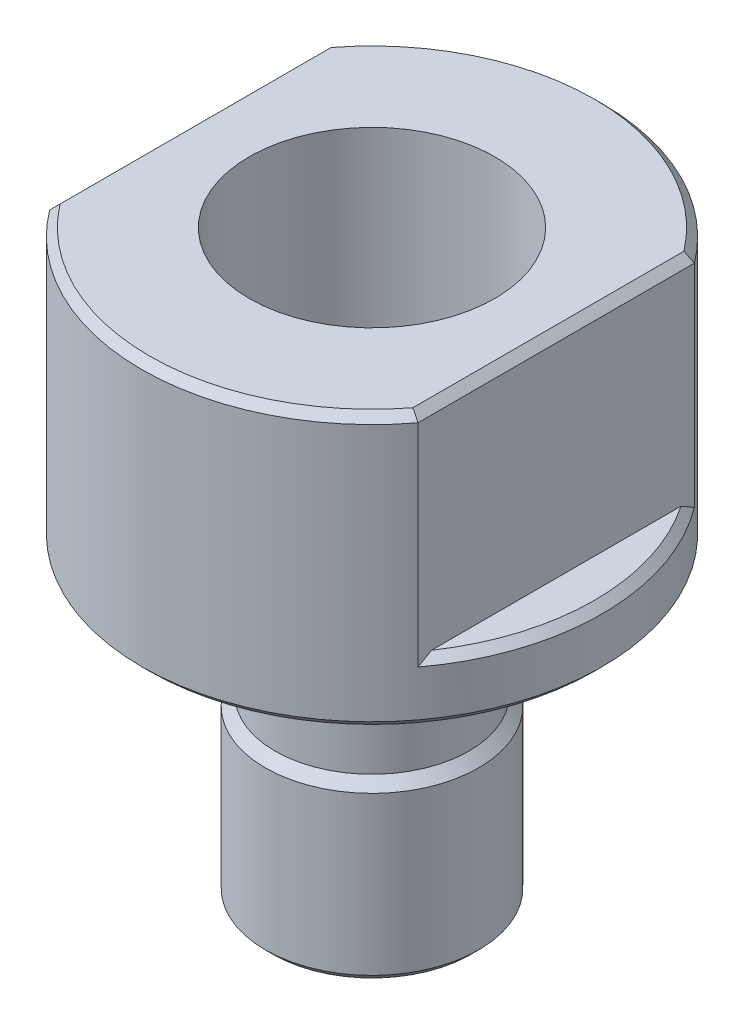
ISO-10303-21;
HEADER;
FILE_DESCRIPTION(('STEP AP214'),'2;1');
FILE_NAME('part.step','',(''),(''),'','','');
FILE_SCHEMA(('AUTOMOTIVE_DESIGN { 1 0 10303 214 1 1 1 1 }'));
ENDSEC;
DATA;
#1=APPLICATION_CONTEXT('core data for automotive mechanical design processes');
#2=APPLICATION_PROTOCOL_DEFINITION('international standard','automotive_design',2000,#1);
#3=PRODUCT_CONTEXT('',#1,'mechanical');
#4=PRODUCT('Part','Part','',(#3));
#5=PRODUCT_RELATED_PRODUCT_CATEGORY('part','',(#4));
#6=PRODUCT_DEFINITION_FORMATION('','',#4);
#7=PRODUCT_DEFINITION_CONTEXT('part definition',#1,'design');
#8=PRODUCT_DEFINITION('design','',#6,#7);
#9=PRODUCT_DEFINITION_SHAPE('','',#8);
#10=(LENGTH_UNIT() NAMED_UNIT(*) SI_UNIT(.MILLI.,.METRE.));
#11=(NAMED_UNIT(*) PLANE_ANGLE_UNIT() SI_UNIT($,.RADIAN.));
#12=(NAMED_UNIT(*) SI_UNIT($,.STERADIAN.) SOLID_ANGLE_UNIT());
#13=UNCERTAINTY_MEASURE_WITH_UNIT(LENGTH_MEASURE(1.E-05),#10,'distance_accuracy_value','');
#14=(GEOMETRIC_REPRESENTATION_CONTEXT(3) GLOBAL_UNCERTAINTY_ASSIGNED_CONTEXT((#13)) GLOBAL_UNIT_ASSIGNED_CONTEXT((#10,
#11,#12)) REPRESENTATION_CONTEXT('',''));
#15=CARTESIAN_POINT('',(0.,0.,0.));
#16=DIRECTION('',(0.,0.,1.));
#17=DIRECTION('',(1.,0.,0.));
#18=AXIS2_PLACEMENT_3D('',#15,#16,#17);
#19=CARTESIAN_POINT('',(4.,0.,0.));
#20=DIRECTION('',(0.,-1.,0.));
#21=DIRECTION('',(0.,0.,-1.));
#22=AXIS2_PLACEMENT_3D('',#19,#20,#21);
#23=PLANE('',#22);
#24=CARTESIAN_POINT('',(0.,0.,0.));
#25=DIRECTION('',(0.,-1.,0.));
#26=DIRECTION('',(0.,0.,-1.));
#27=AXIS2_PLACEMENT_3D('',#24,#25,#26);
#28=CIRCLE('',#27,7.246);
#29=CARTESIAN_POINT('',(5.746,0.,-4.41452149162284));
#30=VERTEX_POINT('',#29);
#31=CARTESIAN_POINT('',(-5.746,0.,-4.41452149162285));
#32=VERTEX_POINT('',#31);
#33=EDGE_CURVE('E124',#30,#32,#28,.F.);
#34=ORIENTED_EDGE('',*,*,#33,.T.);
#35=DIRECTION('',(0.,0.,1.));
#36=VECTOR('',#35,1.);
#37=CARTESIAN_POINT('',(-5.746,0.,4.5));
#38=LINE('',#37,#36);
#39=CARTESIAN_POINT('',(-5.746,0.,4.41452149162285));
#40=VERTEX_POINT('',#39);
#41=EDGE_CURVE('E153',#32,#40,#38,.T.);
#42=ORIENTED_EDGE('',*,*,#41,.T.);
#43=CARTESIAN_POINT('',(0.,0.,0.));
#44=DIRECTION('',(0.,-1.,0.));
#45=DIRECTION('',(0.,0.,-1.));
#46=AXIS2_PLACEMENT_3D('',#43,#44,#45);
#47=CIRCLE('',#46,7.246);
#48=CARTESIAN_POINT('',(5.746,0.,4.41452149162284));
#49=VERTEX_POINT('',#48);
#50=EDGE_CURVE('E127',#40,#49,#47,.F.);
#51=ORIENTED_EDGE('',*,*,#50,.T.);
#52=DIRECTION('',(0.,0.,-1.));
#53=VECTOR('',#52,1.);
#54=CARTESIAN_POINT('',(5.746,0.,-4.5));
#55=LINE('',#54,#53);
#56=EDGE_CURVE('E119',#49,#30,#55,.T.);
#57=ORIENTED_EDGE('',*,*,#56,.T.);
#58=EDGE_LOOP('',(#34,#42,#51,#57));
#59=FACE_BOUND('',#58,.T.);
#60=CARTESIAN_POINT('',(0.,0.,0.));
#61=DIRECTION('',(0.,1.,0.));
#62=DIRECTION('',(0.,0.,1.));
#63=AXIS2_PLACEMENT_3D('',#60,#61,#62);
#64=CIRCLE('',#63,4.);
#65=CARTESIAN_POINT('',(0.,0.,4.));
#66=VERTEX_POINT('',#65);
#67=EDGE_CURVE('E337',#66,#66,#64,.T.);
#68=ORIENTED_EDGE('',*,*,#67,.F.);
#69=EDGE_LOOP('',(#68));
#70=FACE_BOUND('',#69,.T.);
#71=ADVANCED_FACE('F50',(#59,#70),#23,.F.);
#72=CARTESIAN_POINT('',(0.,0.,0.));
#73=DIRECTION('',(0.,1.,0.));
#74=DIRECTION('',(0.,0.,1.));
#75=AXIS2_PLACEMENT_3D('',#72,#73,#74);
#76=CYLINDRICAL_SURFACE('',#75,7.5);
#77=CARTESIAN_POINT('',(0.,-8.636,0.));
#78=DIRECTION('',(0.,1.,0.));
#79=DIRECTION('',(0.,0.,1.));
#80=AXIS2_PLACEMENT_3D('',#77,#78,#79);
#81=CIRCLE('',#80,7.5);
#82=CARTESIAN_POINT('',(0.,-8.636,7.5));
#83=VERTEX_POINT('',#82);
#84=EDGE_CURVE('E148',#83,#83,#81,.T.);
#85=ORIENTED_EDGE('',*,*,#84,.T.);
#86=EDGE_LOOP('',(#85));
#87=FACE_BOUND('',#86,.T.);
#88=DIRECTION('',(0.,1.,0.));
#89=VECTOR('',#88,1.);
#90=CARTESIAN_POINT('',(-6.,0.,4.5));
#91=LINE('',#90,#89);
#92=CARTESIAN_POINT('',(-6.,-7.14399999999999,4.5));
#93=VERTEX_POINT('',#92);
#94=CARTESIAN_POINT('',(-6.,-0.253999999999996,4.5));
#95=VERTEX_POINT('',#94);
#96=EDGE_CURVE('E305',#93,#95,#91,.T.);
#97=ORIENTED_EDGE('',*,*,#96,.F.);
#98=CARTESIAN_POINT('',(0.,-7.14399999999999,0.));
#99=DIRECTION('',(0.,1.,0.));
#100=DIRECTION('',(0.,0.,1.));
#101=AXIS2_PLACEMENT_3D('',#98,#99,#100);
#102=CIRCLE('',#101,7.5);
#103=CARTESIAN_POINT('',(-6.,-7.14399999999999,-4.5));
#104=VERTEX_POINT('',#103);
#105=EDGE_CURVE('E202',#93,#104,#102,.F.);
#106=ORIENTED_EDGE('',*,*,#105,.T.);
#107=DIRECTION('',(0.,1.,0.));
#108=VECTOR('',#107,1.);
#109=CARTESIAN_POINT('',(-6.,0.,-4.5));
#110=LINE('',#109,#108);
#111=CARTESIAN_POINT('',(-6.,-0.253999999999996,-4.5));
#112=VERTEX_POINT('',#111);
#113=EDGE_CURVE('E308',#112,#104,#110,.F.);
#114=ORIENTED_EDGE('',*,*,#113,.F.);
#115=CARTESIAN_POINT('',(0.,-0.253999999999996,0.));
#116=DIRECTION('',(0.,-1.,0.));
#117=DIRECTION('',(0.,0.,-1.));
#118=AXIS2_PLACEMENT_3D('',#115,#116,#117);
#119=CIRCLE('',#118,7.5);
#120=CARTESIAN_POINT('',(6.,-0.253999999999996,-4.5));
#121=VERTEX_POINT('',#120);
#122=EDGE_CURVE('E158',#112,#121,#119,.T.);
#123=ORIENTED_EDGE('',*,*,#122,.T.);
#124=DIRECTION('',(0.,1.,0.));
#125=VECTOR('',#124,1.);
#126=CARTESIAN_POINT('',(6.,0.,-4.5));
#127=LINE('',#126,#125);
#128=CARTESIAN_POINT('',(6.,-7.14399999999999,-4.5));
#129=VERTEX_POINT('',#128);
#130=EDGE_CURVE('E300',#129,#121,#127,.T.);
#131=ORIENTED_EDGE('',*,*,#130,.F.);
#132=CARTESIAN_POINT('',(0.,-7.14399999999999,0.));
#133=DIRECTION('',(0.,1.,0.));
#134=DIRECTION('',(0.,0.,1.));
#135=AXIS2_PLACEMENT_3D('',#132,#133,#134);
#136=CIRCLE('',#135,7.5);
#137=CARTESIAN_POINT('',(6.,-7.14399999999999,4.5));
#138=VERTEX_POINT('',#137);
#139=EDGE_CURVE('E199',#129,#138,#136,.F.);
#140=ORIENTED_EDGE('',*,*,#139,.T.);
#141=DIRECTION('',(0.,1.,0.));
#142=VECTOR('',#141,1.);
#143=CARTESIAN_POINT('',(6.,0.,4.5));
#144=LINE('',#143,#142);
#145=CARTESIAN_POINT('',(6.,-0.253999999999997,4.5));
#146=VERTEX_POINT('',#145);
#147=EDGE_CURVE('E303',#146,#138,#144,.F.);
#148=ORIENTED_EDGE('',*,*,#147,.F.);
#149=CARTESIAN_POINT('',(0.,-0.253999999999996,0.));
#150=DIRECTION('',(0.,-1.,0.));
#151=DIRECTION('',(0.,0.,-1.));
#152=AXIS2_PLACEMENT_3D('',#149,#150,#151);
#153=CIRCLE('',#152,7.5);
#154=EDGE_CURVE('E160',#146,#95,#153,.T.);
#155=ORIENTED_EDGE('',*,*,#154,.T.);
#156=EDGE_LOOP('',(#97,#106,#114,#123,#131,#140,#148,#155));
#157=FACE_BOUND('',#156,.T.);
#158=ADVANCED_FACE('F272',(#87,#157),#76,.T.);
#159=CARTESIAN_POINT('',(7.5,-8.89,0.));
#160=DIRECTION('',(0.,1.,0.));
#161=DIRECTION('',(0.,0.,1.));
#162=AXIS2_PLACEMENT_3D('',#159,#160,#161);
#163=PLANE('',#162);
#164=CARTESIAN_POINT('',(0.,-8.89,0.));
#165=DIRECTION('',(0.,1.,0.));
#166=DIRECTION('',(0.,0.,1.));
#167=AXIS2_PLACEMENT_3D('',#164,#165,#166);
#168=CIRCLE('',#167,7.246);
#169=CARTESIAN_POINT('',(0.,-8.89,7.246));
#170=VERTEX_POINT('',#169);
#171=EDGE_CURVE('E145',#170,#170,#168,.F.);
#172=ORIENTED_EDGE('',*,*,#171,.T.);
#173=EDGE_LOOP('',(#172));
#174=FACE_BOUND('',#173,.T.);
#175=CARTESIAN_POINT('',(0.,-8.89,0.));
#176=DIRECTION('',(0.,1.,0.));
#177=DIRECTION('',(0.,0.,1.));
#178=AXIS2_PLACEMENT_3D('',#175,#176,#177);
#179=CIRCLE('',#178,3.475);
#180=CARTESIAN_POINT('',(0.,-8.89,3.475));
#181=VERTEX_POINT('',#180);
#182=EDGE_CURVE('E310',#181,#181,#179,.T.);
#183=ORIENTED_EDGE('',*,*,#182,.T.);
#184=EDGE_LOOP('',(#183));
#185=FACE_BOUND('',#184,.T.);
#186=ADVANCED_FACE('F268',(#174,#185),#163,.F.);
#187=CARTESIAN_POINT('',(0.,0.,0.));
#188=DIRECTION('',(0.,1.,0.));
#189=DIRECTION('',(0.,0.,1.));
#190=AXIS2_PLACEMENT_3D('',#187,#188,#189);
#191=CYLINDRICAL_SURFACE('',#190,3.475);
#192=ORIENTED_EDGE('',*,*,#182,.F.);
#193=EDGE_LOOP('',(#192));
#194=FACE_BOUND('',#193,.T.);
#195=CARTESIAN_POINT('',(0.,-10.89,0.));
#196=DIRECTION('',(0.,1.,0.));
#197=DIRECTION('',(0.,0.,1.));
#198=AXIS2_PLACEMENT_3D('',#195,#196,#197);
#199=CIRCLE('',#198,3.475);
#200=CARTESIAN_POINT('',(0.,-10.89,3.475));
#201=VERTEX_POINT('',#200);
#202=EDGE_CURVE('E313',#201,#201,#199,.T.);
#203=ORIENTED_EDGE('',*,*,#202,.T.);
#204=EDGE_LOOP('',(#203));
#205=FACE_BOUND('',#204,.T.);
#206=ADVANCED_FACE('F264',(#194,#205),#191,.T.);
#207=CARTESIAN_POINT('',(0.,-11.2058647091106,0.));
#208=DIRECTION('',(0.,1.,0.));
#209=DIRECTION('',(0.,0.,1.));
#210=AXIS2_PLACEMENT_3D('',#207,#208,#209);
#211=CONICAL_SURFACE('',#210,3.15913529088937,0.78539816339745);
#212=ORIENTED_EDGE('',*,*,#202,.F.);
#213=EDGE_LOOP('',(#212));
#214=FACE_BOUND('',#213,.T.);
#215=CARTESIAN_POINT('',(0.,-11.2058647091106,0.));
#216=DIRECTION('',(0.,1.,0.));
#217=DIRECTION('',(0.,0.,1.));
#218=AXIS2_PLACEMENT_3D('',#215,#216,#217);
#219=CIRCLE('',#218,3.15913529088937);
#220=CARTESIAN_POINT('',(0.,-11.2058647091106,3.15913529088937));
#221=VERTEX_POINT('',#220);
#222=EDGE_CURVE('E316',#221,#221,#219,.T.);
#223=ORIENTED_EDGE('',*,*,#222,.T.);
#224=EDGE_LOOP('',(#223));
#225=FACE_BOUND('',#224,.T.);
#226=ADVANCED_FACE('F260',(#214,#225),#211,.T.);
#227=CARTESIAN_POINT('',(0.,0.,0.));
#228=DIRECTION('',(0.,1.,0.));
#229=DIRECTION('',(0.,0.,1.));
#230=AXIS2_PLACEMENT_3D('',#227,#228,#229);
#231=CYLINDRICAL_SURFACE('',#230,3.15913529088937);
#232=ORIENTED_EDGE('',*,*,#222,.F.);
#233=EDGE_LOOP('',(#232));
#234=FACE_BOUND('',#233,.T.);
#235=CARTESIAN_POINT('',(0.,-13.1858647091106,0.));
#236=DIRECTION('',(0.,1.,0.));
#237=DIRECTION('',(0.,0.,1.));
#238=AXIS2_PLACEMENT_3D('',#235,#236,#237);
#239=CIRCLE('',#238,3.15913529088937);
#240=CARTESIAN_POINT('',(0.,-13.1858647091106,3.15913529088937));
#241=VERTEX_POINT('',#240);
#242=EDGE_CURVE('E319',#241,#241,#239,.T.);
#243=ORIENTED_EDGE('',*,*,#242,.T.);
#244=EDGE_LOOP('',(#243));
#245=FACE_BOUND('',#244,.T.);
#246=ADVANCED_FACE('F256',(#234,#245),#231,.T.);
#247=CARTESIAN_POINT('',(0.,-13.5017294182212,0.));
#248=DIRECTION('',(0.,-1.,0.));
#249=DIRECTION('',(0.,0.,-1.));
#250=AXIS2_PLACEMENT_3D('',#247,#248,#249);
#251=CONICAL_SURFACE('',#250,3.475,0.785398163397452);
#252=ORIENTED_EDGE('',*,*,#242,.F.);
#253=EDGE_LOOP('',(#252));
#254=FACE_BOUND('',#253,.T.);
#255=CARTESIAN_POINT('',(0.,-13.5017294182212,0.));
#256=DIRECTION('',(0.,1.,0.));
#257=DIRECTION('',(0.,0.,1.));
#258=AXIS2_PLACEMENT_3D('',#255,#256,#257);
#259=CIRCLE('',#258,3.475);
#260=CARTESIAN_POINT('',(0.,-13.5017294182212,3.475));
#261=VERTEX_POINT('',#260);
#262=EDGE_CURVE('E322',#261,#261,#259,.T.);
#263=ORIENTED_EDGE('',*,*,#262,.T.);
#264=EDGE_LOOP('',(#263));
#265=FACE_BOUND('',#264,.T.);
#266=ADVANCED_FACE('F252',(#254,#265),#251,.T.);
#267=CARTESIAN_POINT('',(0.,0.,0.));
#268=DIRECTION('',(0.,1.,0.));
#269=DIRECTION('',(0.,0.,1.));
#270=AXIS2_PLACEMENT_3D('',#267,#268,#269);
#271=CYLINDRICAL_SURFACE('',#270,3.475);
#272=CARTESIAN_POINT('',(0.,-18.636,0.));
#273=DIRECTION('',(0.,1.,0.));
#274=DIRECTION('',(0.,0.,1.));
#275=AXIS2_PLACEMENT_3D('',#272,#273,#274);
#276=CIRCLE('',#275,3.475);
#277=CARTESIAN_POINT('',(0.,-18.636,3.475));
#278=VERTEX_POINT('',#277);
#279=EDGE_CURVE('E295',#278,#278,#276,.T.);
#280=ORIENTED_EDGE('',*,*,#279,.T.);
#281=EDGE_LOOP('',(#280));
#282=FACE_BOUND('',#281,.T.);
#283=ORIENTED_EDGE('',*,*,#262,.F.);
#284=EDGE_LOOP('',(#283));
#285=FACE_BOUND('',#284,.T.);
#286=ADVANCED_FACE('F248',(#282,#285),#271,.T.);
#287=CARTESIAN_POINT('',(3.475,-18.89,0.));
#288=DIRECTION('',(0.,1.,0.));
#289=DIRECTION('',(0.,0.,1.));
#290=AXIS2_PLACEMENT_3D('',#287,#288,#289);
#291=PLANE('',#290);
#292=CARTESIAN_POINT('',(0.,-18.89,0.));
#293=DIRECTION('',(0.,1.,0.));
#294=DIRECTION('',(0.,0.,1.));
#295=AXIS2_PLACEMENT_3D('',#292,#293,#294);
#296=CIRCLE('',#295,3.22100000000001);
#297=CARTESIAN_POINT('',(0.,-18.89,3.22100000000001));
#298=VERTEX_POINT('',#297);
#299=EDGE_CURVE('E293',#298,#298,#296,.F.);
#300=ORIENTED_EDGE('',*,*,#299,.T.);
#301=EDGE_LOOP('',(#300));
#302=FACE_BOUND('',#301,.T.);
#303=CARTESIAN_POINT('',(0.,-18.89,0.));
#304=DIRECTION('',(0.,1.,0.));
#305=DIRECTION('',(0.,0.,1.));
#306=AXIS2_PLACEMENT_3D('',#303,#304,#305);
#307=CIRCLE('',#306,2.0381);
#308=CARTESIAN_POINT('',(0.,-18.89,2.0381));
#309=VERTEX_POINT('',#308);
#310=EDGE_CURVE('E325',#309,#309,#307,.T.);
#311=ORIENTED_EDGE('',*,*,#310,.T.);
#312=EDGE_LOOP('',(#311));
#313=FACE_BOUND('',#312,.T.);
#314=ADVANCED_FACE('F244',(#302,#313),#291,.F.);
#315=CARTESIAN_POINT('',(0.,0.,0.));
#316=DIRECTION('',(0.,1.,0.));
#317=DIRECTION('',(0.,0.,1.));
#318=AXIS2_PLACEMENT_3D('',#315,#316,#317);
#319=CYLINDRICAL_SURFACE('',#318,2.0381);
#320=ORIENTED_EDGE('',*,*,#310,.F.);
#321=EDGE_LOOP('',(#320));
#322=FACE_BOUND('',#321,.T.);
#323=CARTESIAN_POINT('',(0.,-8.02690000000001,0.));
#324=DIRECTION('',(0.,1.,0.));
#325=DIRECTION('',(0.,0.,1.));
#326=AXIS2_PLACEMENT_3D('',#323,#324,#325);
#327=CIRCLE('',#326,2.0381);
#328=CARTESIAN_POINT('',(0.,-8.02690000000001,2.0381));
#329=VERTEX_POINT('',#328);
#330=EDGE_CURVE('E328',#329,#329,#327,.T.);
#331=ORIENTED_EDGE('',*,*,#330,.T.);
#332=EDGE_LOOP('',(#331));
#333=FACE_BOUND('',#332,.T.);
#334=ADVANCED_FACE('F240',(#322,#333),#319,.F.);
#335=CARTESIAN_POINT('',(0.,-6.89,0.));
#336=DIRECTION('',(0.,1.,0.));
#337=DIRECTION('',(0.,0.,1.));
#338=AXIS2_PLACEMENT_3D('',#335,#336,#337);
#339=CONICAL_SURFACE('',#338,3.175,0.785398163397443);
#340=ORIENTED_EDGE('',*,*,#330,.F.);
#341=EDGE_LOOP('',(#340));
#342=FACE_BOUND('',#341,.T.);
#343=CARTESIAN_POINT('',(0.,-6.89,0.));
#344=DIRECTION('',(0.,1.,0.));
#345=DIRECTION('',(0.,0.,1.));
#346=AXIS2_PLACEMENT_3D('',#343,#344,#345);
#347=CIRCLE('',#346,3.175);
#348=CARTESIAN_POINT('',(0.,-6.89,3.175));
#349=VERTEX_POINT('',#348);
#350=EDGE_CURVE('E331',#349,#349,#347,.T.);
#351=ORIENTED_EDGE('',*,*,#350,.T.);
#352=EDGE_LOOP('',(#351));
#353=FACE_BOUND('',#352,.T.);
#354=ADVANCED_FACE('F236',(#342,#353),#339,.F.);
#355=CARTESIAN_POINT('',(4.,-6.89,0.));
#356=DIRECTION('',(0.,-1.,0.));
#357=DIRECTION('',(0.,0.,-1.));
#358=AXIS2_PLACEMENT_3D('',#355,#356,#357);
#359=PLANE('',#358);
#360=ORIENTED_EDGE('',*,*,#350,.F.);
#361=EDGE_LOOP('',(#360));
#362=FACE_BOUND('',#361,.T.);
#363=CARTESIAN_POINT('',(0.,-6.89,0.));
#364=DIRECTION('',(0.,1.,0.));
#365=DIRECTION('',(0.,0.,1.));
#366=AXIS2_PLACEMENT_3D('',#363,#364,#365);
#367=CIRCLE('',#366,4.);
#368=CARTESIAN_POINT('',(0.,-6.89,4.));
#369=VERTEX_POINT('',#368);
#370=EDGE_CURVE('E334',#369,#369,#367,.T.);
#371=ORIENTED_EDGE('',*,*,#370,.T.);
#372=EDGE_LOOP('',(#371));
#373=FACE_BOUND('',#372,.T.);
#374=ADVANCED_FACE('F232',(#362,#373),#359,.F.);
#375=CARTESIAN_POINT('',(0.,0.,0.));
#376=DIRECTION('',(0.,1.,0.));
#377=DIRECTION('',(0.,0.,1.));
#378=AXIS2_PLACEMENT_3D('',#375,#376,#377);
#379=CYLINDRICAL_SURFACE('',#378,4.);
#380=ORIENTED_EDGE('',*,*,#370,.F.);
#381=EDGE_LOOP('',(#380));
#382=FACE_BOUND('',#381,.T.);
#383=ORIENTED_EDGE('',*,*,#67,.T.);
#384=EDGE_LOOP('',(#383));
#385=FACE_BOUND('',#384,.T.);
#386=ADVANCED_FACE('F228',(#382,#385),#379,.F.);
#387=CARTESIAN_POINT('',(7.5,-6.89,0.));
#388=DIRECTION('',(0.,1.,0.));
#389=DIRECTION('',(0.,0.,1.));
#390=AXIS2_PLACEMENT_3D('',#387,#388,#389);
#391=PLANE('',#390);
#392=DIRECTION('',(0.,0.,-1.));
#393=VECTOR('',#392,1.);
#394=CARTESIAN_POINT('',(-6.,-6.89,10.276728133274));
#395=LINE('',#394,#393);
#396=CARTESIAN_POINT('',(-6.,-6.89,4.0625750454607));
#397=VERTEX_POINT('',#396);
#398=CARTESIAN_POINT('',(-6.,-6.89,-4.0625750454607));
#399=VERTEX_POINT('',#398);
#400=EDGE_CURVE('E139',#397,#399,#395,.T.);
#401=ORIENTED_EDGE('',*,*,#400,.T.);
#402=CARTESIAN_POINT('',(0.,-6.89,0.));
#403=DIRECTION('',(0.,1.,0.));
#404=DIRECTION('',(0.,0.,1.));
#405=AXIS2_PLACEMENT_3D('',#402,#403,#404);
#406=CIRCLE('',#405,7.246);
#407=EDGE_CURVE('E163',#399,#397,#406,.T.);
#408=ORIENTED_EDGE('',*,*,#407,.T.);
#409=EDGE_LOOP('',(#401,#408));
#410=FACE_BOUND('',#409,.T.);
#411=ADVANCED_FACE('F224',(#410),#391,.T.);
#412=CARTESIAN_POINT('',(-6.,-44.5468545929938,10.276728133274));
#413=DIRECTION('',(-1.,0.,0.));
#414=DIRECTION('',(0.,0.,1.));
#415=AXIS2_PLACEMENT_3D('',#412,#413,#414);
#416=PLANE('',#415);
#417=ORIENTED_EDGE('',*,*,#96,.T.);
#418=DIRECTION('',(0.,0.,-1.));
#419=VECTOR('',#418,1.);
#420=CARTESIAN_POINT('',(-6.,-0.253999999999997,-4.5));
#421=LINE('',#420,#419);
#422=EDGE_CURVE('E155',#95,#112,#421,.T.);
#423=ORIENTED_EDGE('',*,*,#422,.T.);
#424=ORIENTED_EDGE('',*,*,#113,.T.);
#425=CARTESIAN_POINT('',(-6.,-7.14399999999999,-4.5));
#426=CARTESIAN_POINT('',(-6.,-7.10059466470886,-4.42771841219986));
#427=CARTESIAN_POINT('',(-6.,-7.05772534961156,-4.3551255729954));
#428=CARTESIAN_POINT('',(-6.,-6.97305868094794,-4.20931725597521));
#429=CARTESIAN_POINT('',(-6.,-6.93126132937858,-4.1361017769999));
#430=CARTESIAN_POINT('',(-6.,-6.89,-4.0625750454607));
#431=B_SPLINE_CURVE_WITH_KNOTS('',3,(#425,#426,#427,#428,#429,#430),.UNSPECIFIED.,.F.,.F.,(4,2,
4),(0.,0.252917943859418,0.505836358843735),.UNSPECIFIED.);
#432=EDGE_CURVE('E214',#104,#399,#431,.T.);
#433=ORIENTED_EDGE('',*,*,#432,.T.);
#434=ORIENTED_EDGE('',*,*,#400,.F.);
#435=CARTESIAN_POINT('',(-6.,-6.89,4.0625750454607));
#436=CARTESIAN_POINT('',(-6.,-6.93126132937858,4.1361017769999));
#437=CARTESIAN_POINT('',(-6.,-6.97305868094794,4.20931725597521));
#438=CARTESIAN_POINT('',(-6.,-7.05772534961156,4.35512557299541));
#439=CARTESIAN_POINT('',(-6.,-7.10059466470886,4.42771841219986));
#440=CARTESIAN_POINT('',(-6.,-7.14399999999999,4.5));
#441=B_SPLINE_CURVE_WITH_KNOTS('',3,(#435,#436,#437,#438,#439,#440),.UNSPECIFIED.,.F.,.F.,(4,2,
4),(0.,0.252918414984317,0.505836358843736),.UNSPECIFIED.);
#442=EDGE_CURVE('E207',#397,#93,#441,.T.);
#443=ORIENTED_EDGE('',*,*,#442,.T.);
#444=EDGE_LOOP('',(#417,#423,#424,#433,#434,#443));
#445=FACE_BOUND('',#444,.T.);
#446=ADVANCED_FACE('F219',(#445),#416,.T.);
#447=CARTESIAN_POINT('',(6.,-44.5468545929938,10.276728133274));
#448=DIRECTION('',(1.,0.,0.));
#449=DIRECTION('',(0.,0.,-1.));
#450=AXIS2_PLACEMENT_3D('',#447,#448,#449);
#451=PLANE('',#450);
#452=ORIENTED_EDGE('',*,*,#130,.T.);
#453=DIRECTION('',(0.,0.,1.));
#454=VECTOR('',#453,1.);
#455=CARTESIAN_POINT('',(6.,-0.253999999999997,4.5));
#456=LINE('',#455,#454);
#457=EDGE_CURVE('E136',#121,#146,#456,.T.);
#458=ORIENTED_EDGE('',*,*,#457,.T.);
#459=ORIENTED_EDGE('',*,*,#147,.T.);
#460=CARTESIAN_POINT('',(6.,-7.14399999999999,4.5));
#461=CARTESIAN_POINT('',(6.,-7.10059466470886,4.42771841219986));
#462=CARTESIAN_POINT('',(6.,-7.05772534961156,4.3551255729954));
#463=CARTESIAN_POINT('',(6.,-6.97305868094794,4.20931725597521));
#464=CARTESIAN_POINT('',(6.,-6.93126132937858,4.1361017769999));
#465=CARTESIAN_POINT('',(6.,-6.89,4.0625750454607));
#466=B_SPLINE_CURVE_WITH_KNOTS('',3,(#460,#461,#462,#463,#464,#465),.UNSPECIFIED.,.F.,.F.,(4,2,
4),(0.,0.252917943859418,0.505836358843735),.UNSPECIFIED.);
#467=CARTESIAN_POINT('',(6.,-6.89,4.0625750454607));
#468=VERTEX_POINT('',#467);
#469=EDGE_CURVE('E14',#138,#468,#466,.T.);
#470=ORIENTED_EDGE('',*,*,#469,.T.);
#471=DIRECTION('',(0.,0.,1.));
#472=VECTOR('',#471,1.);
#473=CARTESIAN_POINT('',(6.,-6.89,10.276728133274));
#474=LINE('',#473,#472);
#475=CARTESIAN_POINT('',(6.,-6.89,-4.0625750454607));
#476=VERTEX_POINT('',#475);
#477=EDGE_CURVE('E340',#476,#468,#474,.T.);
#478=ORIENTED_EDGE('',*,*,#477,.F.);
#479=CARTESIAN_POINT('',(6.,-6.89,-4.0625750454607));
#480=CARTESIAN_POINT('',(6.,-6.93126132937858,-4.1361017769999));
#481=CARTESIAN_POINT('',(6.,-6.97305868094794,-4.20931725597521));
#482=CARTESIAN_POINT('',(6.,-7.05772534961156,-4.3551255729954));
#483=CARTESIAN_POINT('',(6.,-7.10059466470886,-4.42771841219986));
#484=CARTESIAN_POINT('',(6.,-7.14399999999999,-4.5));
#485=B_SPLINE_CURVE_WITH_KNOTS('',3,(#479,#480,#481,#482,#483,#484),.UNSPECIFIED.,.F.,.F.,(4,2,
4),(0.,0.252918414984318,0.505836358843736),.UNSPECIFIED.);
#486=EDGE_CURVE('E63',#476,#129,#485,.T.);
#487=ORIENTED_EDGE('',*,*,#486,.T.);
#488=EDGE_LOOP('',(#452,#458,#459,#470,#478,#487));
#489=FACE_BOUND('',#488,.T.);
#490=ADVANCED_FACE('F223',(#489),#451,.T.);
#491=ORIENTED_EDGE('',*,*,#477,.T.);
#492=CARTESIAN_POINT('',(0.,-6.89,0.));
#493=DIRECTION('',(0.,1.,0.));
#494=DIRECTION('',(0.,0.,1.));
#495=AXIS2_PLACEMENT_3D('',#492,#493,#494);
#496=CIRCLE('',#495,7.246);
#497=EDGE_CURVE('E205',#468,#476,#496,.T.);
#498=ORIENTED_EDGE('',*,*,#497,.T.);
#499=EDGE_LOOP('',(#491,#498));
#500=FACE_BOUND('',#499,.T.);
#501=ADVANCED_FACE('F282',(#500),#391,.T.);
#502=CARTESIAN_POINT('',(0.,-18.636,0.));
#503=DIRECTION('',(0.,1.,0.));
#504=DIRECTION('',(0.,0.,1.));
#505=AXIS2_PLACEMENT_3D('',#502,#503,#504);
#506=CONICAL_SURFACE('',#505,3.475,0.785398163397442);
#507=ORIENTED_EDGE('',*,*,#299,.F.);
#508=EDGE_LOOP('',(#507));
#509=FACE_BOUND('',#508,.T.);
#510=ORIENTED_EDGE('',*,*,#279,.F.);
#511=EDGE_LOOP('',(#510));
#512=FACE_BOUND('',#511,.T.);
#513=ADVANCED_FACE('F279',(#509,#512),#506,.T.);
#514=CARTESIAN_POINT('',(0.,-8.636,0.));
#515=DIRECTION('',(0.,1.,0.));
#516=DIRECTION('',(0.,0.,1.));
#517=AXIS2_PLACEMENT_3D('',#514,#515,#516);
#518=CONICAL_SURFACE('',#517,7.5,0.785398163397455);
#519=ORIENTED_EDGE('',*,*,#171,.F.);
#520=EDGE_LOOP('',(#519));
#521=FACE_BOUND('',#520,.T.);
#522=ORIENTED_EDGE('',*,*,#84,.F.);
#523=EDGE_LOOP('',(#522));
#524=FACE_BOUND('',#523,.T.);
#525=ADVANCED_FACE('F281',(#521,#524),#518,.T.);
#526=CARTESIAN_POINT('',(5.746,0.,0.));
#527=DIRECTION('',(0.707106781186546,0.707106781186549,0.));
#528=DIRECTION('',(0.,0.,1.));
#529=AXIS2_PLACEMENT_3D('',#526,#527,#528);
#530=PLANE('',#529);
#531=CARTESIAN_POINT('',(5.746,0.,4.41452149162284));
#532=CARTESIAN_POINT('',(5.78831158076315,-0.0423115807631484,4.42889719086027));
#533=CARTESIAN_POINT('',(5.83063403823666,-0.0846340382366603,4.44320824965215));
#534=CARTESIAN_POINT('',(5.9153007049042,-0.169300704904199,4.47170108577268));
#535=CARTESIAN_POINT('',(5.95764491409736,-0.211644914097353,4.48588286310651));
#536=CARTESIAN_POINT('',(6.,-0.253999999999996,4.5));
#537=B_SPLINE_CURVE_WITH_KNOTS('',3,(#531,#532,#533,#534,#535,#536),.UNSPECIFIED.,.F.,.F.,(4,2,
4),(0.,0.184620380652986,0.369240753891158),.UNSPECIFIED.);
#538=EDGE_CURVE('E140',#146,#49,#537,.F.);
#539=ORIENTED_EDGE('',*,*,#538,.F.);
#540=ORIENTED_EDGE('',*,*,#457,.F.);
#541=CARTESIAN_POINT('',(5.746,0.,-4.41452149162284));
#542=CARTESIAN_POINT('',(5.78831158076315,-0.0423115807631484,-4.42889719086027));
#543=CARTESIAN_POINT('',(5.83063403823666,-0.0846340382366603,-4.44320824965215));
#544=CARTESIAN_POINT('',(5.9153007049042,-0.169300704904199,-4.47170108577268));
#545=CARTESIAN_POINT('',(5.95764491409736,-0.211644914097353,-4.48588286310651));
#546=CARTESIAN_POINT('',(6.,-0.253999999999996,-4.5));
#547=B_SPLINE_CURVE_WITH_KNOTS('',3,(#541,#542,#543,#544,#545,#546),.UNSPECIFIED.,.F.,.F.,(4,2,
4),(0.,0.184620380652986,0.369240753891158),.UNSPECIFIED.);
#548=EDGE_CURVE('E134',#30,#121,#547,.T.);
#549=ORIENTED_EDGE('',*,*,#548,.F.);
#550=ORIENTED_EDGE('',*,*,#56,.F.);
#551=EDGE_LOOP('',(#539,#540,#549,#550));
#552=FACE_BOUND('',#551,.T.);
#553=ADVANCED_FACE('F135',(#552),#530,.T.);
#554=CARTESIAN_POINT('',(0.,0.,0.));
#555=DIRECTION('',(0.,-1.,0.));
#556=DIRECTION('',(0.,0.,-1.));
#557=AXIS2_PLACEMENT_3D('',#554,#555,#556);
#558=CONICAL_SURFACE('',#557,7.246,0.785398163397453);
#559=ORIENTED_EDGE('',*,*,#548,.T.);
#560=ORIENTED_EDGE('',*,*,#122,.F.);
#561=CARTESIAN_POINT('',(-6.,-0.253999999999996,-4.5));
#562=CARTESIAN_POINT('',(-5.95764491409736,-0.211644914097353,-4.48588286310651));
#563=CARTESIAN_POINT('',(-5.9153007049042,-0.1693007049042,-4.47170108577268));
#564=CARTESIAN_POINT('',(-5.83063403823666,-0.0846340382366603,-4.44320824965215));
#565=CARTESIAN_POINT('',(-5.78831158076315,-0.0423115807631482,-4.42889719086027));
#566=CARTESIAN_POINT('',(-5.746,0.,-4.41452149162285));
#567=B_SPLINE_CURVE_WITH_KNOTS('',3,(#561,#562,#563,#564,#565,#566),.UNSPECIFIED.,.F.,.F.,(4,2,
4),(0.,0.184620373238172,0.369240753891158),.UNSPECIFIED.);
#568=EDGE_CURVE('E143',#32,#112,#567,.F.);
#569=ORIENTED_EDGE('',*,*,#568,.F.);
#570=ORIENTED_EDGE('',*,*,#33,.F.);
#571=EDGE_LOOP('',(#559,#560,#569,#570));
#572=FACE_BOUND('',#571,.T.);
#573=ADVANCED_FACE('F142',(#572),#558,.T.);
#574=CARTESIAN_POINT('',(0.,0.,0.));
#575=DIRECTION('',(0.,-1.,0.));
#576=DIRECTION('',(0.,0.,-1.));
#577=AXIS2_PLACEMENT_3D('',#574,#575,#576);
#578=CONICAL_SURFACE('',#577,7.246,0.785398163397453);
#579=ORIENTED_EDGE('',*,*,#538,.T.);
#580=ORIENTED_EDGE('',*,*,#50,.F.);
#581=CARTESIAN_POINT('',(-5.746,0.,4.41452149162285));
#582=CARTESIAN_POINT('',(-5.78831158076315,-0.0423115807631483,4.42889719086027));
#583=CARTESIAN_POINT('',(-5.83063403823666,-0.0846340382366603,4.44320824965215));
#584=CARTESIAN_POINT('',(-5.9153007049042,-0.1693007049042,4.47170108577268));
#585=CARTESIAN_POINT('',(-5.95764491409736,-0.211644914097353,4.48588286310651));
#586=CARTESIAN_POINT('',(-6.,-0.253999999999997,4.5));
#587=B_SPLINE_CURVE_WITH_KNOTS('',3,(#581,#582,#583,#584,#585,#586),.UNSPECIFIED.,.F.,.F.,(4,2,
4),(0.,0.184620380652986,0.369240753891158),.UNSPECIFIED.);
#588=EDGE_CURVE('E164',#95,#40,#587,.F.);
#589=ORIENTED_EDGE('',*,*,#588,.F.);
#590=ORIENTED_EDGE('',*,*,#154,.F.);
#591=EDGE_LOOP('',(#579,#580,#589,#590));
#592=FACE_BOUND('',#591,.T.);
#593=ADVANCED_FACE('F176',(#592),#578,.T.);
#594=CARTESIAN_POINT('',(-5.746,0.,0.));
#595=DIRECTION('',(-0.707106781186546,0.707106781186549,0.));
#596=DIRECTION('',(0.,0.,-1.));
#597=AXIS2_PLACEMENT_3D('',#594,#595,#596);
#598=PLANE('',#597);
#599=ORIENTED_EDGE('',*,*,#568,.T.);
#600=ORIENTED_EDGE('',*,*,#422,.F.);
#601=ORIENTED_EDGE('',*,*,#588,.T.);
#602=ORIENTED_EDGE('',*,*,#41,.F.);
#603=EDGE_LOOP('',(#599,#600,#601,#602));
#604=FACE_BOUND('',#603,.T.);
#605=ADVANCED_FACE('F179',(#604),#598,.T.);
#606=CARTESIAN_POINT('',(0.,-6.89,0.));
#607=DIRECTION('',(0.,-1.,0.));
#608=DIRECTION('',(0.,0.,-1.));
#609=AXIS2_PLACEMENT_3D('',#606,#607,#608);
#610=CONICAL_SURFACE('',#609,7.246,0.785398163397453);
#611=ORIENTED_EDGE('',*,*,#432,.F.);
#612=ORIENTED_EDGE('',*,*,#105,.F.);
#613=ORIENTED_EDGE('',*,*,#442,.F.);
#614=ORIENTED_EDGE('',*,*,#407,.F.);
#615=EDGE_LOOP('',(#611,#612,#613,#614));
#616=FACE_BOUND('',#615,.T.);
#617=ADVANCED_FACE('F182',(#616),#610,.T.);
#618=CARTESIAN_POINT('',(0.,-6.89,0.));
#619=DIRECTION('',(0.,-1.,0.));
#620=DIRECTION('',(0.,0.,-1.));
#621=AXIS2_PLACEMENT_3D('',#618,#619,#620);
#622=CONICAL_SURFACE('',#621,7.246,0.785398163397453);
#623=ORIENTED_EDGE('',*,*,#469,.F.);
#624=ORIENTED_EDGE('',*,*,#139,.F.);
#625=ORIENTED_EDGE('',*,*,#486,.F.);
#626=ORIENTED_EDGE('',*,*,#497,.F.);
#627=EDGE_LOOP('',(#623,#624,#625,#626));
#628=FACE_BOUND('',#627,.T.);
#629=ADVANCED_FACE('F52',(#628),#622,.T.);
#630=CLOSED_SHELL('',(#71,#158,#186,#206,#226,#246,#266,#286,#314,#334,#354,#374,#386,#411,#446,
#490,#501,#513,#525,#553,#573,#593,#605,#617,#629));
#631=MANIFOLD_SOLID_BREP('B2',#630);
#632=ADVANCED_BREP_SHAPE_REPRESENTATION('',(#18,#631),#14);
#633=SHAPE_DEFINITION_REPRESENTATION(#9,#632);
ENDSEC;
END-ISO-10303-21;
